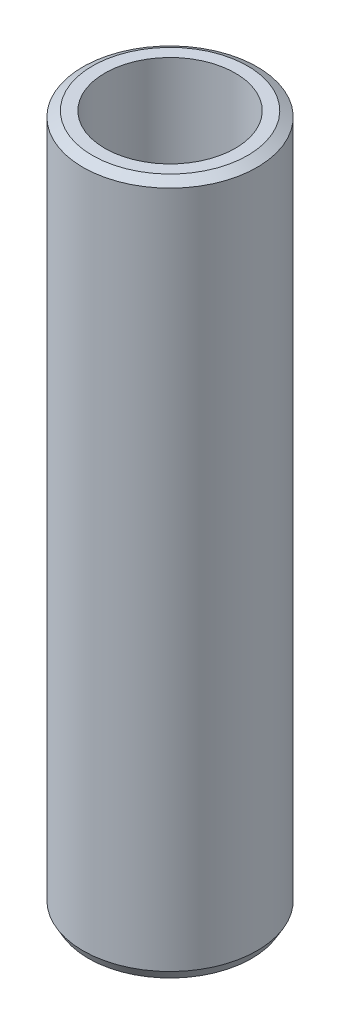
ISO-10303-21;
HEADER;
FILE_DESCRIPTION(('STEP AP214'),'2;1');
FILE_NAME('part.step','',(''),(''),'','','');
FILE_SCHEMA(('AUTOMOTIVE_DESIGN { 1 0 10303 214 1 1 1 1 }'));
ENDSEC;
DATA;
#1=APPLICATION_CONTEXT('core data for automotive mechanical design processes');
#2=APPLICATION_PROTOCOL_DEFINITION('international standard','automotive_design',2000,#1);
#3=PRODUCT_CONTEXT('',#1,'mechanical');
#4=PRODUCT('Part','Part','',(#3));
#5=PRODUCT_RELATED_PRODUCT_CATEGORY('part','',(#4));
#6=PRODUCT_DEFINITION_FORMATION('','',#4);
#7=PRODUCT_DEFINITION_CONTEXT('part definition',#1,'design');
#8=PRODUCT_DEFINITION('design','',#6,#7);
#9=PRODUCT_DEFINITION_SHAPE('','',#8);
#10=(LENGTH_UNIT() NAMED_UNIT(*) SI_UNIT(.MILLI.,.METRE.));
#11=(NAMED_UNIT(*) PLANE_ANGLE_UNIT() SI_UNIT($,.RADIAN.));
#12=(NAMED_UNIT(*) SI_UNIT($,.STERADIAN.) SOLID_ANGLE_UNIT());
#13=UNCERTAINTY_MEASURE_WITH_UNIT(LENGTH_MEASURE(1.E-05),#10,'distance_accuracy_value','');
#14=(GEOMETRIC_REPRESENTATION_CONTEXT(3) GLOBAL_UNCERTAINTY_ASSIGNED_CONTEXT((#13)) GLOBAL_UNIT_ASSIGNED_CONTEXT((#10,
#11,#12)) REPRESENTATION_CONTEXT('',''));
#15=CARTESIAN_POINT('',(0.,0.,0.));
#16=DIRECTION('',(0.,0.,1.));
#17=DIRECTION('',(1.,0.,0.));
#18=AXIS2_PLACEMENT_3D('',#15,#16,#17);
#19=CARTESIAN_POINT('',(0.,278.606741562114,0.));
#20=DIRECTION('',(0.,-1.,0.));
#21=DIRECTION('',(0.,0.,-1.));
#22=AXIS2_PLACEMENT_3D('',#19,#20,#21);
#23=CYLINDRICAL_SURFACE('',#22,35.);
#24=CARTESIAN_POINT('',(0.,276.399015099186,0.));
#25=DIRECTION('',(0.,1.,0.));
#26=DIRECTION('',(0.,0.,1.));
#27=AXIS2_PLACEMENT_3D('',#24,#25,#26);
#28=CIRCLE('',#27,35.);
#29=CARTESIAN_POINT('',(0.,276.399015099186,35.));
#30=VERTEX_POINT('',#29);
#31=EDGE_CURVE('E50',#30,#30,#28,.F.);
#32=ORIENTED_EDGE('',*,*,#31,.T.);
#33=EDGE_LOOP('',(#32));
#34=FACE_BOUND('',#33,.T.);
#35=CARTESIAN_POINT('',(0.,3.82389440300601,0.));
#36=DIRECTION('',(0.,1.,0.));
#37=DIRECTION('',(0.,0.,1.));
#38=AXIS2_PLACEMENT_3D('',#35,#36,#37);
#39=CIRCLE('',#38,35.);
#40=CARTESIAN_POINT('',(0.,3.82389440300601,35.));
#41=VERTEX_POINT('',#40);
#42=EDGE_CURVE('E51',#41,#41,#39,.T.);
#43=ORIENTED_EDGE('',*,*,#42,.T.);
#44=EDGE_LOOP('',(#43));
#45=FACE_BOUND('',#44,.T.);
#46=ADVANCED_FACE('F39',(#34,#45),#23,.T.);
#47=CARTESIAN_POINT('',(0.,278.606741562114,0.));
#48=DIRECTION('',(0.,1.,0.));
#49=DIRECTION('',(0.,0.,1.));
#50=AXIS2_PLACEMENT_3D('',#47,#48,#49);
#51=PLANE('',#50);
#52=CARTESIAN_POINT('',(0.,278.606741562114,0.));
#53=DIRECTION('',(0.,1.,0.));
#54=DIRECTION('',(0.,0.,1.));
#55=AXIS2_PLACEMENT_3D('',#52,#53,#54);
#56=CIRCLE('',#55,31.176105596994);
#57=CARTESIAN_POINT('',(0.,278.606741562114,31.176105596994));
#58=VERTEX_POINT('',#57);
#59=EDGE_CURVE('E54',#58,#58,#56,.T.);
#60=ORIENTED_EDGE('',*,*,#59,.T.);
#61=EDGE_LOOP('',(#60));
#62=FACE_BOUND('',#61,.T.);
#63=CARTESIAN_POINT('',(0.,278.606741562114,0.));
#64=DIRECTION('',(0.,1.,0.));
#65=DIRECTION('',(0.,0.,1.));
#66=AXIS2_PLACEMENT_3D('',#63,#64,#65);
#67=CIRCLE('',#66,26.2025366600405);
#68=CARTESIAN_POINT('',(0.,278.606741562114,26.2025366600405));
#69=VERTEX_POINT('',#68);
#70=EDGE_CURVE('E58',#69,#69,#67,.T.);
#71=ORIENTED_EDGE('',*,*,#70,.F.);
#72=EDGE_LOOP('',(#71));
#73=FACE_BOUND('',#72,.T.);
#74=ADVANCED_FACE('F69',(#62,#73),#51,.T.);
#75=CARTESIAN_POINT('',(0.,0.,0.));
#76=DIRECTION('',(0.,1.,0.));
#77=DIRECTION('',(0.,0.,1.));
#78=AXIS2_PLACEMENT_3D('',#75,#76,#77);
#79=PLANE('',#78);
#80=CARTESIAN_POINT('',(0.,0.,0.));
#81=DIRECTION('',(0.,1.,0.));
#82=DIRECTION('',(0.,0.,1.));
#83=AXIS2_PLACEMENT_3D('',#80,#81,#82);
#84=CIRCLE('',#83,32.7922735370718);
#85=CARTESIAN_POINT('',(0.,0.,32.7922735370718));
#86=VERTEX_POINT('',#85);
#87=EDGE_CURVE('E10',#86,#86,#84,.F.);
#88=ORIENTED_EDGE('',*,*,#87,.T.);
#89=EDGE_LOOP('',(#88));
#90=FACE_BOUND('',#89,.T.);
#91=CARTESIAN_POINT('',(0.,0.,0.));
#92=DIRECTION('',(0.,1.,0.));
#93=DIRECTION('',(0.,0.,1.));
#94=AXIS2_PLACEMENT_3D('',#91,#92,#93);
#95=CIRCLE('',#94,26.2025366600405);
#96=CARTESIAN_POINT('',(0.,0.,26.2025366600405));
#97=VERTEX_POINT('',#96);
#98=EDGE_CURVE('E63',#97,#97,#95,.T.);
#99=ORIENTED_EDGE('',*,*,#98,.T.);
#100=EDGE_LOOP('',(#99));
#101=FACE_BOUND('',#100,.T.);
#102=ADVANCED_FACE('F75',(#90,#101),#79,.F.);
#103=CARTESIAN_POINT('',(0.,278.606741562114,0.));
#104=DIRECTION('',(0.,-1.,0.));
#105=DIRECTION('',(0.,0.,-1.));
#106=AXIS2_PLACEMENT_3D('',#103,#104,#105);
#107=CYLINDRICAL_SURFACE('',#106,26.2025366600405);
#108=ORIENTED_EDGE('',*,*,#70,.T.);
#109=EDGE_LOOP('',(#108));
#110=FACE_BOUND('',#109,.T.);
#111=ORIENTED_EDGE('',*,*,#98,.F.);
#112=EDGE_LOOP('',(#111));
#113=FACE_BOUND('',#112,.T.);
#114=ADVANCED_FACE('F70',(#110,#113),#107,.F.);
#115=CARTESIAN_POINT('',(0.,278.606741562114,0.));
#116=DIRECTION('',(0.,-1.,0.));
#117=DIRECTION('',(0.,0.,-1.));
#118=AXIS2_PLACEMENT_3D('',#115,#116,#117);
#119=CONICAL_SURFACE('',#118,31.176105596994,1.0471975511966);
#120=ORIENTED_EDGE('',*,*,#31,.F.);
#121=EDGE_LOOP('',(#120));
#122=FACE_BOUND('',#121,.T.);
#123=ORIENTED_EDGE('',*,*,#59,.F.);
#124=EDGE_LOOP('',(#123));
#125=FACE_BOUND('',#124,.T.);
#126=ADVANCED_FACE('F81',(#122,#125),#119,.T.);
#127=CARTESIAN_POINT('',(0.,3.82389440300601,0.));
#128=DIRECTION('',(0.,1.,0.));
#129=DIRECTION('',(0.,0.,1.));
#130=AXIS2_PLACEMENT_3D('',#127,#128,#129);
#131=CONICAL_SURFACE('',#130,35.,0.523598775598301);
#132=ORIENTED_EDGE('',*,*,#87,.F.);
#133=EDGE_LOOP('',(#132));
#134=FACE_BOUND('',#133,.T.);
#135=ORIENTED_EDGE('',*,*,#42,.F.);
#136=EDGE_LOOP('',(#135));
#137=FACE_BOUND('',#136,.T.);
#138=ADVANCED_FACE('F45',(#134,#137),#131,.T.);
#139=CLOSED_SHELL('',(#46,#74,#102,#114,#126,#138));
#140=MANIFOLD_SOLID_BREP('B2',#139);
#141=ADVANCED_BREP_SHAPE_REPRESENTATION('',(#18,#140),#14);
#142=SHAPE_DEFINITION_REPRESENTATION(#9,#141);
ENDSEC;
END-ISO-10303-21;
